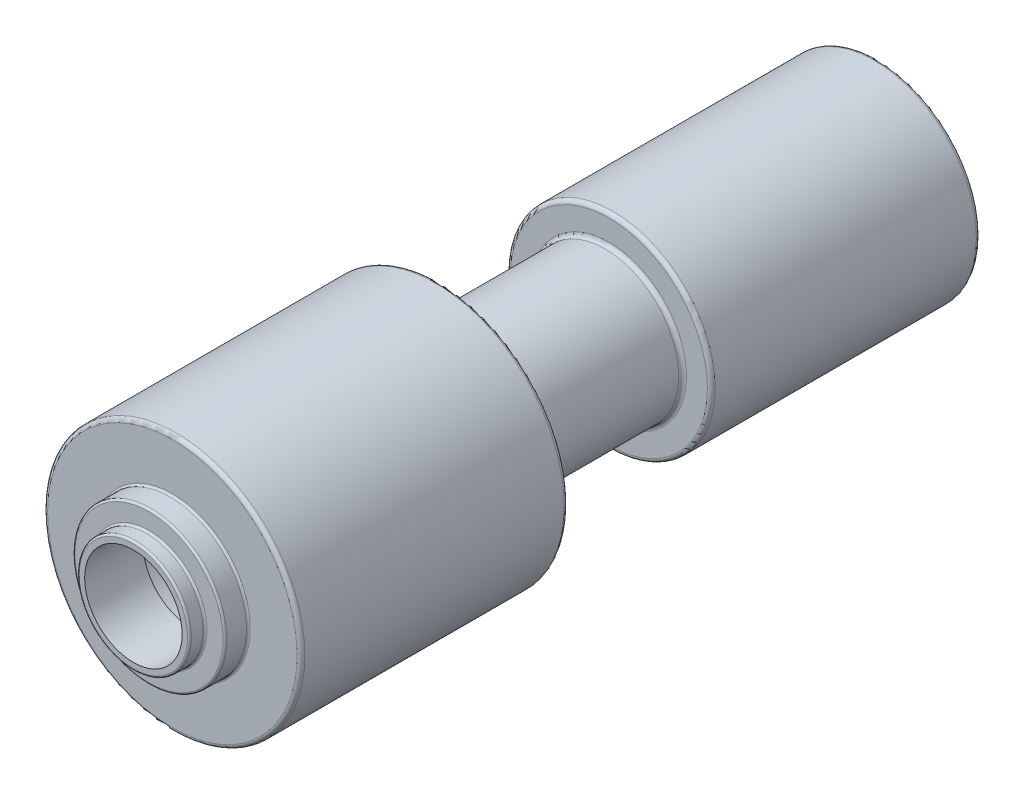
ISO-10303-21;
HEADER;
FILE_DESCRIPTION(('STEP AP214'),'2;1');
FILE_NAME('part.step','',(''),(''),'','','');
FILE_SCHEMA(('AUTOMOTIVE_DESIGN { 1 0 10303 214 1 1 1 1 }'));
ENDSEC;
DATA;
#1=APPLICATION_CONTEXT('core data for automotive mechanical design processes');
#2=APPLICATION_PROTOCOL_DEFINITION('international standard','automotive_design',2000,#1);
#3=PRODUCT_CONTEXT('',#1,'mechanical');
#4=PRODUCT('Part','Part','',(#3));
#5=PRODUCT_RELATED_PRODUCT_CATEGORY('part','',(#4));
#6=PRODUCT_DEFINITION_FORMATION('','',#4);
#7=PRODUCT_DEFINITION_CONTEXT('part definition',#1,'design');
#8=PRODUCT_DEFINITION('design','',#6,#7);
#9=PRODUCT_DEFINITION_SHAPE('','',#8);
#10=(LENGTH_UNIT() NAMED_UNIT(*) SI_UNIT(.MILLI.,.METRE.));
#11=(NAMED_UNIT(*) PLANE_ANGLE_UNIT() SI_UNIT($,.RADIAN.));
#12=(NAMED_UNIT(*) SI_UNIT($,.STERADIAN.) SOLID_ANGLE_UNIT());
#13=UNCERTAINTY_MEASURE_WITH_UNIT(LENGTH_MEASURE(1.E-05),#10,'distance_accuracy_value','');
#14=(GEOMETRIC_REPRESENTATION_CONTEXT(3) GLOBAL_UNCERTAINTY_ASSIGNED_CONTEXT((#13)) GLOBAL_UNIT_ASSIGNED_CONTEXT((#10,
#11,#12)) REPRESENTATION_CONTEXT('',''));
#15=CARTESIAN_POINT('',(0.,0.,0.));
#16=DIRECTION('',(0.,0.,1.));
#17=DIRECTION('',(1.,0.,0.));
#18=AXIS2_PLACEMENT_3D('',#15,#16,#17);
#19=CARTESIAN_POINT('',(0.,0.,0.));
#20=DIRECTION('',(0.,0.,-1.));
#21=DIRECTION('',(-1.,0.,0.));
#22=AXIS2_PLACEMENT_3D('',#19,#20,#21);
#23=PLANE('',#22);
#24=CARTESIAN_POINT('',(0.,0.,0.));
#25=DIRECTION('',(0.,0.,-1.));
#26=DIRECTION('',(-1.,0.,0.));
#27=AXIS2_PLACEMENT_3D('',#24,#25,#26);
#28=CIRCLE('',#27,27.75);
#29=CARTESIAN_POINT('',(-27.75,0.,0.));
#30=VERTEX_POINT('',#29);
#31=EDGE_CURVE('E57',#30,#30,#28,.F.);
#32=ORIENTED_EDGE('',*,*,#31,.T.);
#33=EDGE_LOOP('',(#32));
#34=FACE_BOUND('',#33,.T.);
#35=CARTESIAN_POINT('',(0.,0.,0.));
#36=DIRECTION('',(0.,0.,-1.));
#37=DIRECTION('',(-1.,0.,0.));
#38=AXIS2_PLACEMENT_3D('',#35,#36,#37);
#39=CIRCLE('',#38,25.);
#40=CARTESIAN_POINT('',(-25.,0.,0.));
#41=VERTEX_POINT('',#40);
#42=EDGE_CURVE('E206',#41,#41,#39,.F.);
#43=ORIENTED_EDGE('',*,*,#42,.F.);
#44=EDGE_LOOP('',(#43));
#45=FACE_BOUND('',#44,.T.);
#46=ADVANCED_FACE('F17',(#34,#45),#23,.F.);
#47=CARTESIAN_POINT('',(0.,0.,0.));
#48=DIRECTION('',(0.,0.,1.));
#49=DIRECTION('',(1.,0.,0.));
#50=AXIS2_PLACEMENT_3D('',#47,#48,#49);
#51=CYLINDRICAL_SURFACE('',#50,28.75);
#52=CARTESIAN_POINT('',(0.,0.,-1.));
#53=DIRECTION('',(0.,0.,-1.));
#54=DIRECTION('',(-1.,0.,0.));
#55=AXIS2_PLACEMENT_3D('',#52,#53,#54);
#56=CIRCLE('',#55,28.75);
#57=CARTESIAN_POINT('',(-28.75,0.,-1.));
#58=VERTEX_POINT('',#57);
#59=EDGE_CURVE('E62',#58,#58,#56,.T.);
#60=ORIENTED_EDGE('',*,*,#59,.T.);
#61=EDGE_LOOP('',(#60));
#62=FACE_BOUND('',#61,.T.);
#63=CARTESIAN_POINT('',(0.,0.,-7.));
#64=DIRECTION('',(0.,0.,-1.));
#65=DIRECTION('',(-1.,0.,0.));
#66=AXIS2_PLACEMENT_3D('',#63,#64,#65);
#67=CIRCLE('',#66,28.75);
#68=CARTESIAN_POINT('',(-28.75,0.,-7.));
#69=VERTEX_POINT('',#68);
#70=EDGE_CURVE('E60',#69,#69,#67,.F.);
#71=ORIENTED_EDGE('',*,*,#70,.T.);
#72=EDGE_LOOP('',(#71));
#73=FACE_BOUND('',#72,.T.);
#74=ADVANCED_FACE('F82',(#62,#73),#51,.T.);
#75=CARTESIAN_POINT('',(0.,28.75,-8.));
#76=DIRECTION('',(0.,0.,-1.));
#77=DIRECTION('',(-1.,0.,0.));
#78=AXIS2_PLACEMENT_3D('',#75,#76,#77);
#79=PLANE('',#78);
#80=CARTESIAN_POINT('',(0.,0.,-8.));
#81=DIRECTION('',(0.,0.,-1.));
#82=DIRECTION('',(-1.,0.,0.));
#83=AXIS2_PLACEMENT_3D('',#80,#81,#82);
#84=CIRCLE('',#83,29.75);
#85=CARTESIAN_POINT('',(-29.75,0.,-8.));
#86=VERTEX_POINT('',#85);
#87=EDGE_CURVE('E33',#86,#86,#84,.T.);
#88=ORIENTED_EDGE('',*,*,#87,.T.);
#89=EDGE_LOOP('',(#88));
#90=FACE_BOUND('',#89,.T.);
#91=CARTESIAN_POINT('',(0.,0.,-8.));
#92=DIRECTION('',(0.,0.,-1.));
#93=DIRECTION('',(-1.,0.,0.));
#94=AXIS2_PLACEMENT_3D('',#91,#92,#93);
#95=CIRCLE('',#94,38.);
#96=CARTESIAN_POINT('',(-38.,0.,-8.));
#97=VERTEX_POINT('',#96);
#98=EDGE_CURVE('E65',#97,#97,#95,.F.);
#99=ORIENTED_EDGE('',*,*,#98,.T.);
#100=EDGE_LOOP('',(#99));
#101=FACE_BOUND('',#100,.T.);
#102=ADVANCED_FACE('F72',(#90,#101),#79,.F.);
#103=CARTESIAN_POINT('',(0.,0.,0.));
#104=DIRECTION('',(0.,0.,1.));
#105=DIRECTION('',(1.,0.,0.));
#106=AXIS2_PLACEMENT_3D('',#103,#104,#105);
#107=CYLINDRICAL_SURFACE('',#106,39.);
#108=CARTESIAN_POINT('',(0.,0.,-19.));
#109=DIRECTION('',(0.,0.,-1.));
#110=DIRECTION('',(-1.,0.,0.));
#111=AXIS2_PLACEMENT_3D('',#108,#109,#110);
#112=CIRCLE('',#111,39.);
#113=CARTESIAN_POINT('',(-39.,0.,-19.));
#114=VERTEX_POINT('',#113);
#115=EDGE_CURVE('E25',#114,#114,#112,.F.);
#116=ORIENTED_EDGE('',*,*,#115,.T.);
#117=EDGE_LOOP('',(#116));
#118=FACE_BOUND('',#117,.T.);
#119=CARTESIAN_POINT('',(0.,0.,-9.));
#120=DIRECTION('',(0.,0.,-1.));
#121=DIRECTION('',(-1.,0.,0.));
#122=AXIS2_PLACEMENT_3D('',#119,#120,#121);
#123=CIRCLE('',#122,39.);
#124=CARTESIAN_POINT('',(-39.,0.,-9.));
#125=VERTEX_POINT('',#124);
#126=EDGE_CURVE('E29',#125,#125,#123,.T.);
#127=ORIENTED_EDGE('',*,*,#126,.T.);
#128=EDGE_LOOP('',(#127));
#129=FACE_BOUND('',#128,.T.);
#130=ADVANCED_FACE('F92',(#118,#129),#107,.T.);
#131=CARTESIAN_POINT('',(0.,39.,-20.));
#132=DIRECTION('',(0.,0.,-1.));
#133=DIRECTION('',(-1.,0.,0.));
#134=AXIS2_PLACEMENT_3D('',#131,#132,#133);
#135=PLANE('',#134);
#136=CARTESIAN_POINT('',(0.,0.,-20.));
#137=DIRECTION('',(0.,0.,-1.));
#138=DIRECTION('',(-1.,0.,0.));
#139=AXIS2_PLACEMENT_3D('',#136,#137,#138);
#140=CIRCLE('',#139,40.);
#141=CARTESIAN_POINT('',(-40.,0.,-20.));
#142=VERTEX_POINT('',#141);
#143=EDGE_CURVE('E11',#142,#142,#140,.T.);
#144=ORIENTED_EDGE('',*,*,#143,.T.);
#145=EDGE_LOOP('',(#144));
#146=FACE_BOUND('',#145,.T.);
#147=CARTESIAN_POINT('',(0.,0.,-20.));
#148=DIRECTION('',(0.,0.,-1.));
#149=DIRECTION('',(-1.,0.,0.));
#150=AXIS2_PLACEMENT_3D('',#147,#148,#149);
#151=CIRCLE('',#150,64.);
#152=CARTESIAN_POINT('',(-64.,0.,-20.));
#153=VERTEX_POINT('',#152);
#154=EDGE_CURVE('E51',#153,#153,#151,.F.);
#155=ORIENTED_EDGE('',*,*,#154,.T.);
#156=EDGE_LOOP('',(#155));
#157=FACE_BOUND('',#156,.T.);
#158=ADVANCED_FACE('F140',(#146,#157),#135,.F.);
#159=CARTESIAN_POINT('',(0.,0.,0.));
#160=DIRECTION('',(0.,0.,1.));
#161=DIRECTION('',(1.,0.,0.));
#162=AXIS2_PLACEMENT_3D('',#159,#160,#161);
#163=CYLINDRICAL_SURFACE('',#162,66.);
#164=CARTESIAN_POINT('',(0.,0.,-155.));
#165=DIRECTION('',(0.,0.,1.));
#166=DIRECTION('',(1.,0.,0.));
#167=AXIS2_PLACEMENT_3D('',#164,#165,#166);
#168=CIRCLE('',#167,66.);
#169=CARTESIAN_POINT('',(66.,0.,-155.));
#170=VERTEX_POINT('',#169);
#171=EDGE_CURVE('E47',#170,#170,#168,.T.);
#172=ORIENTED_EDGE('',*,*,#171,.T.);
#173=EDGE_LOOP('',(#172));
#174=FACE_BOUND('',#173,.T.);
#175=CARTESIAN_POINT('',(0.,0.,-22.));
#176=DIRECTION('',(0.,0.,-1.));
#177=DIRECTION('',(-1.,0.,0.));
#178=AXIS2_PLACEMENT_3D('',#175,#176,#177);
#179=CIRCLE('',#178,66.);
#180=CARTESIAN_POINT('',(-66.,0.,-22.));
#181=VERTEX_POINT('',#180);
#182=EDGE_CURVE('E52',#181,#181,#179,.T.);
#183=ORIENTED_EDGE('',*,*,#182,.T.);
#184=EDGE_LOOP('',(#183));
#185=FACE_BOUND('',#184,.T.);
#186=ADVANCED_FACE('F145',(#174,#185),#163,.T.);
#187=CARTESIAN_POINT('',(0.,66.,-157.));
#188=DIRECTION('',(0.,0.,1.));
#189=DIRECTION('',(1.,0.,0.));
#190=AXIS2_PLACEMENT_3D('',#187,#188,#189);
#191=PLANE('',#190);
#192=CARTESIAN_POINT('',(0.,0.,-157.));
#193=DIRECTION('',(0.,0.,1.));
#194=DIRECTION('',(1.,0.,0.));
#195=AXIS2_PLACEMENT_3D('',#192,#193,#194);
#196=CIRCLE('',#195,39.75);
#197=CARTESIAN_POINT('',(39.75,0.,-157.));
#198=VERTEX_POINT('',#197);
#199=EDGE_CURVE('E228',#198,#198,#196,.T.);
#200=ORIENTED_EDGE('',*,*,#199,.T.);
#201=EDGE_LOOP('',(#200));
#202=FACE_BOUND('',#201,.T.);
#203=CARTESIAN_POINT('',(0.,0.,-157.));
#204=DIRECTION('',(0.,0.,1.));
#205=DIRECTION('',(1.,0.,0.));
#206=AXIS2_PLACEMENT_3D('',#203,#204,#205);
#207=CIRCLE('',#206,64.);
#208=CARTESIAN_POINT('',(64.,0.,-157.));
#209=VERTEX_POINT('',#208);
#210=EDGE_CURVE('E232',#209,#209,#207,.F.);
#211=ORIENTED_EDGE('',*,*,#210,.T.);
#212=EDGE_LOOP('',(#211));
#213=FACE_BOUND('',#212,.T.);
#214=ADVANCED_FACE('F150',(#202,#213),#191,.F.);
#215=CARTESIAN_POINT('',(0.,0.,0.));
#216=DIRECTION('',(0.,0.,1.));
#217=DIRECTION('',(1.,0.,0.));
#218=AXIS2_PLACEMENT_3D('',#215,#216,#217);
#219=CYLINDRICAL_SURFACE('',#218,37.75);
#220=CARTESIAN_POINT('',(0.,0.,-242.));
#221=DIRECTION('',(0.,0.,-1.));
#222=DIRECTION('',(-1.,0.,0.));
#223=AXIS2_PLACEMENT_3D('',#220,#221,#222);
#224=CIRCLE('',#223,37.75);
#225=CARTESIAN_POINT('',(-37.75,0.,-242.));
#226=VERTEX_POINT('',#225);
#227=EDGE_CURVE('E235',#226,#226,#224,.F.);
#228=ORIENTED_EDGE('',*,*,#227,.T.);
#229=EDGE_LOOP('',(#228));
#230=FACE_BOUND('',#229,.T.);
#231=CARTESIAN_POINT('',(0.,0.,-159.));
#232=DIRECTION('',(0.,0.,1.));
#233=DIRECTION('',(1.,0.,0.));
#234=AXIS2_PLACEMENT_3D('',#231,#232,#233);
#235=CIRCLE('',#234,37.75);
#236=CARTESIAN_POINT('',(37.75,0.,-159.));
#237=VERTEX_POINT('',#236);
#238=EDGE_CURVE('E237',#237,#237,#235,.F.);
#239=ORIENTED_EDGE('',*,*,#238,.T.);
#240=EDGE_LOOP('',(#239));
#241=FACE_BOUND('',#240,.T.);
#242=ADVANCED_FACE('F154',(#230,#241),#219,.T.);
#243=CARTESIAN_POINT('',(0.,37.75,-244.));
#244=DIRECTION('',(0.,0.,-1.));
#245=DIRECTION('',(-1.,0.,0.));
#246=AXIS2_PLACEMENT_3D('',#243,#244,#245);
#247=PLANE('',#246);
#248=CARTESIAN_POINT('',(0.,0.,-244.));
#249=DIRECTION('',(0.,0.,-1.));
#250=DIRECTION('',(-1.,0.,0.));
#251=AXIS2_PLACEMENT_3D('',#248,#249,#250);
#252=CIRCLE('',#251,50.5);
#253=CARTESIAN_POINT('',(-50.5,0.,-244.));
#254=VERTEX_POINT('',#253);
#255=EDGE_CURVE('E223',#254,#254,#252,.F.);
#256=ORIENTED_EDGE('',*,*,#255,.T.);
#257=EDGE_LOOP('',(#256));
#258=FACE_BOUND('',#257,.T.);
#259=CARTESIAN_POINT('',(0.,0.,-244.));
#260=DIRECTION('',(0.,0.,-1.));
#261=DIRECTION('',(-1.,0.,0.));
#262=AXIS2_PLACEMENT_3D('',#259,#260,#261);
#263=CIRCLE('',#262,39.75);
#264=CARTESIAN_POINT('',(-39.75,0.,-244.));
#265=VERTEX_POINT('',#264);
#266=EDGE_CURVE('E219',#265,#265,#263,.T.);
#267=ORIENTED_EDGE('',*,*,#266,.T.);
#268=EDGE_LOOP('',(#267));
#269=FACE_BOUND('',#268,.T.);
#270=ADVANCED_FACE('F158',(#258,#269),#247,.F.);
#271=CARTESIAN_POINT('',(0.,0.,0.));
#272=DIRECTION('',(0.,0.,1.));
#273=DIRECTION('',(1.,0.,0.));
#274=AXIS2_PLACEMENT_3D('',#271,#272,#273);
#275=CYLINDRICAL_SURFACE('',#274,52.5);
#276=CARTESIAN_POINT('',(0.,0.,-380.));
#277=DIRECTION('',(0.,0.,1.));
#278=DIRECTION('',(1.,0.,0.));
#279=AXIS2_PLACEMENT_3D('',#276,#277,#278);
#280=CIRCLE('',#279,52.5);
#281=CARTESIAN_POINT('',(52.5,0.,-380.));
#282=VERTEX_POINT('',#281);
#283=EDGE_CURVE('E212',#282,#282,#280,.T.);
#284=ORIENTED_EDGE('',*,*,#283,.T.);
#285=EDGE_LOOP('',(#284));
#286=FACE_BOUND('',#285,.T.);
#287=CARTESIAN_POINT('',(0.,0.,-246.));
#288=DIRECTION('',(0.,0.,-1.));
#289=DIRECTION('',(-1.,0.,0.));
#290=AXIS2_PLACEMENT_3D('',#287,#288,#289);
#291=CIRCLE('',#290,52.5);
#292=CARTESIAN_POINT('',(-52.5,0.,-246.));
#293=VERTEX_POINT('',#292);
#294=EDGE_CURVE('E208',#293,#293,#291,.T.);
#295=ORIENTED_EDGE('',*,*,#294,.T.);
#296=EDGE_LOOP('',(#295));
#297=FACE_BOUND('',#296,.T.);
#298=ADVANCED_FACE('F162',(#286,#297),#275,.T.);
#299=CARTESIAN_POINT('',(0.,52.5,-382.));
#300=DIRECTION('',(0.,0.,1.));
#301=DIRECTION('',(1.,0.,0.));
#302=AXIS2_PLACEMENT_3D('',#299,#300,#301);
#303=PLANE('',#302);
#304=CARTESIAN_POINT('',(0.,0.,-382.));
#305=DIRECTION('',(0.,0.,1.));
#306=DIRECTION('',(1.,0.,0.));
#307=AXIS2_PLACEMENT_3D('',#304,#305,#306);
#308=CIRCLE('',#307,50.5);
#309=CARTESIAN_POINT('',(50.5,0.,-382.));
#310=VERTEX_POINT('',#309);
#311=EDGE_CURVE('E216',#310,#310,#308,.F.);
#312=ORIENTED_EDGE('',*,*,#311,.T.);
#313=EDGE_LOOP('',(#312));
#314=FACE_BOUND('',#313,.T.);
#315=ADVANCED_FACE('F166',(#314),#303,.F.);
#316=CARTESIAN_POINT('',(0.,0.,26.2440012633931));
#317=DIRECTION('',(0.,0.,1.));
#318=DIRECTION('',(1.,0.,0.));
#319=AXIS2_PLACEMENT_3D('',#316,#317,#318);
#320=CYLINDRICAL_SURFACE('',#319,25.);
#321=CARTESIAN_POINT('',(0.,0.,-30.));
#322=DIRECTION('',(0.,0.,1.));
#323=DIRECTION('',(1.,0.,0.));
#324=AXIS2_PLACEMENT_3D('',#321,#322,#323);
#325=CIRCLE('',#324,25.);
#326=CARTESIAN_POINT('',(25.,0.,-30.));
#327=VERTEX_POINT('',#326);
#328=EDGE_CURVE('E195',#327,#327,#325,.T.);
#329=ORIENTED_EDGE('',*,*,#328,.F.);
#330=EDGE_LOOP('',(#329));
#331=FACE_BOUND('',#330,.T.);
#332=ORIENTED_EDGE('',*,*,#42,.T.);
#333=EDGE_LOOP('',(#332));
#334=FACE_BOUND('',#333,.T.);
#335=ADVANCED_FACE('F170',(#331,#334),#320,.F.);
#336=CARTESIAN_POINT('',(0.,25.,-30.));
#337=DIRECTION('',(0.,0.,-1.));
#338=DIRECTION('',(-1.,0.,0.));
#339=AXIS2_PLACEMENT_3D('',#336,#337,#338);
#340=PLANE('',#339);
#341=ORIENTED_EDGE('',*,*,#328,.T.);
#342=EDGE_LOOP('',(#341));
#343=FACE_BOUND('',#342,.T.);
#344=CARTESIAN_POINT('',(0.,0.,-30.));
#345=DIRECTION('',(0.,0.,1.));
#346=DIRECTION('',(1.,0.,0.));
#347=AXIS2_PLACEMENT_3D('',#344,#345,#346);
#348=CIRCLE('',#347,37.5);
#349=CARTESIAN_POINT('',(37.5,0.,-30.));
#350=VERTEX_POINT('',#349);
#351=EDGE_CURVE('E192',#350,#350,#348,.T.);
#352=ORIENTED_EDGE('',*,*,#351,.F.);
#353=EDGE_LOOP('',(#352));
#354=FACE_BOUND('',#353,.T.);
#355=ADVANCED_FACE('F174',(#343,#354),#340,.T.);
#356=CARTESIAN_POINT('',(0.,0.,26.2440012633931));
#357=DIRECTION('',(0.,0.,1.));
#358=DIRECTION('',(1.,0.,0.));
#359=AXIS2_PLACEMENT_3D('',#356,#357,#358);
#360=CYLINDRICAL_SURFACE('',#359,37.5);
#361=ORIENTED_EDGE('',*,*,#351,.T.);
#362=EDGE_LOOP('',(#361));
#363=FACE_BOUND('',#362,.T.);
#364=CARTESIAN_POINT('',(0.,0.,-140.));
#365=DIRECTION('',(0.,0.,1.));
#366=DIRECTION('',(1.,0.,0.));
#367=AXIS2_PLACEMENT_3D('',#364,#365,#366);
#368=CIRCLE('',#367,37.5);
#369=CARTESIAN_POINT('',(37.5,0.,-140.));
#370=VERTEX_POINT('',#369);
#371=EDGE_CURVE('E190',#370,#370,#368,.T.);
#372=ORIENTED_EDGE('',*,*,#371,.F.);
#373=EDGE_LOOP('',(#372));
#374=FACE_BOUND('',#373,.T.);
#375=ADVANCED_FACE('F178',(#363,#374),#360,.F.);
#376=CARTESIAN_POINT('',(0.,37.5,-140.));
#377=DIRECTION('',(0.,0.,1.));
#378=DIRECTION('',(1.,0.,0.));
#379=AXIS2_PLACEMENT_3D('',#376,#377,#378);
#380=PLANE('',#379);
#381=ORIENTED_EDGE('',*,*,#371,.T.);
#382=EDGE_LOOP('',(#381));
#383=FACE_BOUND('',#382,.T.);
#384=ADVANCED_FACE('F102',(#383),#380,.T.);
#385=CARTESIAN_POINT('',(0.,0.,-380.));
#386=DIRECTION('',(0.,0.,1.));
#387=DIRECTION('',(1.,0.,0.));
#388=AXIS2_PLACEMENT_3D('',#385,#386,#387);
#389=TOROIDAL_SURFACE('',#388,50.5,2.);
#390=ORIENTED_EDGE('',*,*,#311,.F.);
#391=EDGE_LOOP('',(#390));
#392=FACE_BOUND('',#391,.T.);
#393=ORIENTED_EDGE('',*,*,#283,.F.);
#394=EDGE_LOOP('',(#393));
#395=FACE_BOUND('',#394,.T.);
#396=ADVANCED_FACE('F98',(#392,#395),#389,.T.);
#397=CARTESIAN_POINT('',(0.,0.,-246.));
#398=DIRECTION('',(0.,0.,-1.));
#399=DIRECTION('',(-1.,0.,0.));
#400=AXIS2_PLACEMENT_3D('',#397,#398,#399);
#401=TOROIDAL_SURFACE('',#400,50.5,2.);
#402=ORIENTED_EDGE('',*,*,#294,.F.);
#403=EDGE_LOOP('',(#402));
#404=FACE_BOUND('',#403,.T.);
#405=ORIENTED_EDGE('',*,*,#255,.F.);
#406=EDGE_LOOP('',(#405));
#407=FACE_BOUND('',#406,.T.);
#408=ADVANCED_FACE('F101',(#404,#407),#401,.T.);
#409=CARTESIAN_POINT('',(0.,0.,-242.));
#410=DIRECTION('',(0.,0.,-1.));
#411=DIRECTION('',(-1.,0.,0.));
#412=AXIS2_PLACEMENT_3D('',#409,#410,#411);
#413=TOROIDAL_SURFACE('',#412,39.75,2.);
#414=ORIENTED_EDGE('',*,*,#266,.F.);
#415=EDGE_LOOP('',(#414));
#416=FACE_BOUND('',#415,.T.);
#417=ORIENTED_EDGE('',*,*,#227,.F.);
#418=EDGE_LOOP('',(#417));
#419=FACE_BOUND('',#418,.T.);
#420=ADVANCED_FACE('F106',(#416,#419),#413,.F.);
#421=CARTESIAN_POINT('',(0.,0.,-159.));
#422=DIRECTION('',(0.,0.,1.));
#423=DIRECTION('',(1.,0.,0.));
#424=AXIS2_PLACEMENT_3D('',#421,#422,#423);
#425=TOROIDAL_SURFACE('',#424,39.75,2.);
#426=ORIENTED_EDGE('',*,*,#238,.F.);
#427=EDGE_LOOP('',(#426));
#428=FACE_BOUND('',#427,.T.);
#429=ORIENTED_EDGE('',*,*,#199,.F.);
#430=EDGE_LOOP('',(#429));
#431=FACE_BOUND('',#430,.T.);
#432=ADVANCED_FACE('F110',(#428,#431),#425,.F.);
#433=CARTESIAN_POINT('',(0.,0.,-155.));
#434=DIRECTION('',(0.,0.,1.));
#435=DIRECTION('',(1.,0.,0.));
#436=AXIS2_PLACEMENT_3D('',#433,#434,#435);
#437=TOROIDAL_SURFACE('',#436,64.,2.);
#438=ORIENTED_EDGE('',*,*,#210,.F.);
#439=EDGE_LOOP('',(#438));
#440=FACE_BOUND('',#439,.T.);
#441=ORIENTED_EDGE('',*,*,#171,.F.);
#442=EDGE_LOOP('',(#441));
#443=FACE_BOUND('',#442,.T.);
#444=ADVANCED_FACE('F114',(#440,#443),#437,.T.);
#445=CARTESIAN_POINT('',(0.,0.,-22.));
#446=DIRECTION('',(0.,0.,-1.));
#447=DIRECTION('',(-1.,0.,0.));
#448=AXIS2_PLACEMENT_3D('',#445,#446,#447);
#449=TOROIDAL_SURFACE('',#448,64.,2.);
#450=ORIENTED_EDGE('',*,*,#182,.F.);
#451=EDGE_LOOP('',(#450));
#452=FACE_BOUND('',#451,.T.);
#453=ORIENTED_EDGE('',*,*,#154,.F.);
#454=EDGE_LOOP('',(#453));
#455=FACE_BOUND('',#454,.T.);
#456=ADVANCED_FACE('F118',(#452,#455),#449,.T.);
#457=CARTESIAN_POINT('',(0.,0.,-1.));
#458=DIRECTION('',(0.,0.,-1.));
#459=DIRECTION('',(-1.,0.,0.));
#460=AXIS2_PLACEMENT_3D('',#457,#458,#459);
#461=TOROIDAL_SURFACE('',#460,27.75,1.);
#462=ORIENTED_EDGE('',*,*,#59,.F.);
#463=EDGE_LOOP('',(#462));
#464=FACE_BOUND('',#463,.T.);
#465=ORIENTED_EDGE('',*,*,#31,.F.);
#466=EDGE_LOOP('',(#465));
#467=FACE_BOUND('',#466,.T.);
#468=ADVANCED_FACE('F78',(#464,#467),#461,.T.);
#469=CARTESIAN_POINT('',(0.,0.,-7.));
#470=DIRECTION('',(0.,0.,-1.));
#471=DIRECTION('',(-1.,0.,0.));
#472=AXIS2_PLACEMENT_3D('',#469,#470,#471);
#473=TOROIDAL_SURFACE('',#472,29.75,1.);
#474=ORIENTED_EDGE('',*,*,#87,.F.);
#475=EDGE_LOOP('',(#474));
#476=FACE_BOUND('',#475,.T.);
#477=ORIENTED_EDGE('',*,*,#70,.F.);
#478=EDGE_LOOP('',(#477));
#479=FACE_BOUND('',#478,.T.);
#480=ADVANCED_FACE('F74',(#476,#479),#473,.F.);
#481=CARTESIAN_POINT('',(0.,0.,-19.));
#482=DIRECTION('',(0.,0.,-1.));
#483=DIRECTION('',(-1.,0.,0.));
#484=AXIS2_PLACEMENT_3D('',#481,#482,#483);
#485=TOROIDAL_SURFACE('',#484,40.,1.);
#486=ORIENTED_EDGE('',*,*,#143,.F.);
#487=EDGE_LOOP('',(#486));
#488=FACE_BOUND('',#487,.T.);
#489=ORIENTED_EDGE('',*,*,#115,.F.);
#490=EDGE_LOOP('',(#489));
#491=FACE_BOUND('',#490,.T.);
#492=ADVANCED_FACE('F77',(#488,#491),#485,.F.);
#493=CARTESIAN_POINT('',(0.,0.,-9.));
#494=DIRECTION('',(0.,0.,-1.));
#495=DIRECTION('',(-1.,0.,0.));
#496=AXIS2_PLACEMENT_3D('',#493,#494,#495);
#497=TOROIDAL_SURFACE('',#496,38.,1.);
#498=ORIENTED_EDGE('',*,*,#126,.F.);
#499=EDGE_LOOP('',(#498));
#500=FACE_BOUND('',#499,.T.);
#501=ORIENTED_EDGE('',*,*,#98,.F.);
#502=EDGE_LOOP('',(#501));
#503=FACE_BOUND('',#502,.T.);
#504=ADVANCED_FACE('F19',(#500,#503),#497,.T.);
#505=CLOSED_SHELL('',(#46,#74,#102,#130,#158,#186,#214,#242,#270,#298,#315,#335,#355,#375,#384,
#396,#408,#420,#432,#444,#456,#468,#480,#492,#504));
#506=MANIFOLD_SOLID_BREP('B1',#505);
#507=ADVANCED_BREP_SHAPE_REPRESENTATION('',(#18,#506),#14);
#508=SHAPE_DEFINITION_REPRESENTATION(#9,#507);
ENDSEC;
END-ISO-10303-21;
